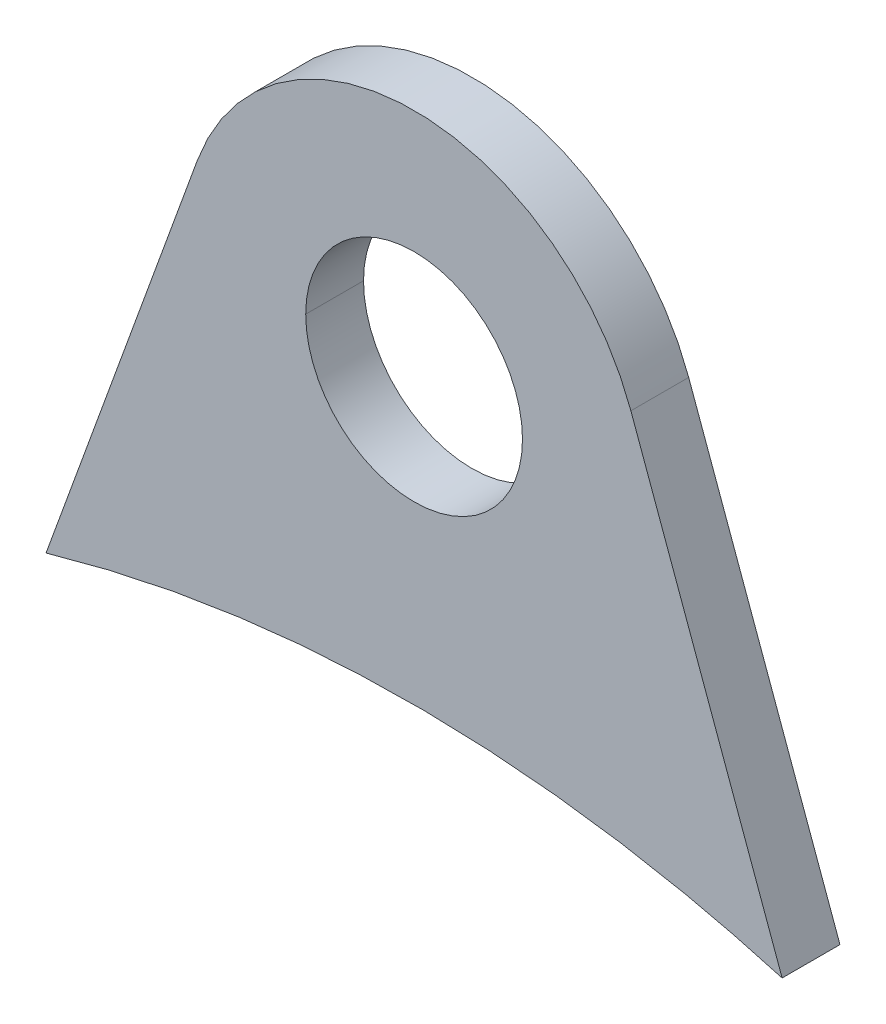
ISO-10303-21;
HEADER;
FILE_DESCRIPTION(('STEP AP214'),'2;1');
FILE_NAME('part.step','',(''),(''),'','','');
FILE_SCHEMA(('AUTOMOTIVE_DESIGN { 1 0 10303 214 1 1 1 1 }'));
ENDSEC;
DATA;
#1=APPLICATION_CONTEXT('core data for automotive mechanical design processes');
#2=APPLICATION_PROTOCOL_DEFINITION('international standard','automotive_design',2000,#1);
#3=PRODUCT_CONTEXT('',#1,'mechanical');
#4=PRODUCT('Part','Part','',(#3));
#5=PRODUCT_RELATED_PRODUCT_CATEGORY('part','',(#4));
#6=PRODUCT_DEFINITION_FORMATION('','',#4);
#7=PRODUCT_DEFINITION_CONTEXT('part definition',#1,'design');
#8=PRODUCT_DEFINITION('design','',#6,#7);
#9=PRODUCT_DEFINITION_SHAPE('','',#8);
#10=(LENGTH_UNIT() NAMED_UNIT(*) SI_UNIT(.MILLI.,.METRE.));
#11=(NAMED_UNIT(*) PLANE_ANGLE_UNIT() SI_UNIT($,.RADIAN.));
#12=(NAMED_UNIT(*) SI_UNIT($,.STERADIAN.) SOLID_ANGLE_UNIT());
#13=UNCERTAINTY_MEASURE_WITH_UNIT(LENGTH_MEASURE(1.E-05),#10,'distance_accuracy_value','');
#14=(GEOMETRIC_REPRESENTATION_CONTEXT(3) GLOBAL_UNCERTAINTY_ASSIGNED_CONTEXT((#13)) GLOBAL_UNIT_ASSIGNED_CONTEXT((#10,
#11,#12)) REPRESENTATION_CONTEXT('',''));
#15=CARTESIAN_POINT('',(0.,0.,0.));
#16=DIRECTION('',(0.,0.,1.));
#17=DIRECTION('',(1.,0.,0.));
#18=AXIS2_PLACEMENT_3D('',#15,#16,#17);
#19=CARTESIAN_POINT('',(237.511961473644,-296.982955426363,6.80414238108646E-12));
#20=DIRECTION('',(0.689605532614527,0.724185203789359,0.));
#21=DIRECTION('',(0.512076268434418,-0.487624748455492,0.707106781186548));
#22=AXIS2_PLACEMENT_3D('',#19,#20,#21);
#23=TOROIDAL_SURFACE('',#22,328.,181.5);
#24=CARTESIAN_POINT('',(50.7061588567263,103.465463207252,4.00000000000006));
#25=CARTESIAN_POINT('',(50.8043560138696,103.439726310511,3.3898563822652));
#26=CARTESIAN_POINT('',(50.8800297766086,103.419816936713,2.77674567944246));
#27=CARTESIAN_POINT('',(50.9331187111287,103.405836050409,2.16065704181465));
#28=(BOUNDED_CURVE() B_SPLINE_CURVE(3,(#24,#25,#26,#27),.UNSPECIFIED.,.F.,
.F.) B_SPLINE_CURVE_WITH_KNOTS((4,4),(2.0260284622211E-07,0.0018544541188316),
.UNSPECIFIED.) CURVE() GEOMETRIC_REPRESENTATION_ITEM() RATIONAL_B_SPLINE_CURVE((1.,1.,1.,1.)) REPRESENTATION_ITEM(''));
#29=CARTESIAN_POINT('',(50.7061588567263,103.465463207252,3.99999999999985));
#30=VERTEX_POINT('',#29);
#31=CARTESIAN_POINT('',(50.9331187111287,103.405836050409,2.16065704181465));
#32=VERTEX_POINT('',#31);
#33=EDGE_CURVE('E116',#30,#32,#28,.T.);
#34=ORIENTED_EDGE('',*,*,#33,.F.);
#35=CARTESIAN_POINT('',(-50.9331187111209,103.405836050411,3.99999999999963));
#36=CARTESIAN_POINT('',(-48.4554874316032,104.130085725673,3.99999999999963));
#37=CARTESIAN_POINT('',(-45.9623884437121,104.801410169951,3.99999999999963));
#38=CARTESIAN_POINT('',(-40.9498127506431,106.03714510248,3.99999999999963));
#39=CARTESIAN_POINT('',(-38.4303358460173,106.601554781712,3.99999999999963));
#40=CARTESIAN_POINT('',(-33.3691560762568,107.622475173787,3.99999999999963));
#41=CARTESIAN_POINT('',(-30.8274493923148,108.078966954495,3.99999999999963));
#42=CARTESIAN_POINT('',(-25.72690150179,108.883100152258,3.99999999999963));
#43=CARTESIAN_POINT('',(-23.1680604929796,109.230742823495,3.99999999999963));
#44=CARTESIAN_POINT('',(-18.0976552647956,109.809723605771,3.99999999999963));
#45=CARTESIAN_POINT('',(-15.5863785846811,110.043582769014,3.99999999999963));
#46=CARTESIAN_POINT('',(-10.5562643496409,110.406461640257,3.99999999999963));
#47=CARTESIAN_POINT('',(-8.03742680006194,110.535481422379,3.99999999999963));
#48=CARTESIAN_POINT('',(-2.99721715390254,110.688434022884,3.99999999999963));
#49=CARTESIAN_POINT('',(-0.475845909114352,110.71239476846,3.99999999999963));
#50=CARTESIAN_POINT('',(4.56549841829255,110.655276623093,3.99999999999963));
#51=CARTESIAN_POINT('',(7.08547157214704,110.574203694047,3.99999999999963));
#52=CARTESIAN_POINT('',(13.0518071298569,110.257706439247,3.99999999999963));
#53=CARTESIAN_POINT('',(16.4958354524429,109.976259544864,3.99999999999963));
#54=CARTESIAN_POINT('',(23.3614712063294,109.217399483766,3.99999999999963));
#55=CARTESIAN_POINT('',(26.783082269806,108.740018903234,3.99999999999963));
#56=CARTESIAN_POINT('',(33.649371278072,107.581388912212,3.99999999999963));
#57=CARTESIAN_POINT('',(37.0935134325157,106.896937551427,3.99999999999963));
#58=CARTESIAN_POINT('',(42.2255157604827,105.721407591177,3.99999999999963));
#59=CARTESIAN_POINT('',(43.9307273137237,105.304683892417,3.99999999999963));
#60=CARTESIAN_POINT('',(47.328350710528,104.421953788333,3.99999999999963));
#61=CARTESIAN_POINT('',(49.0207625237442,103.955947266204,3.99999999999963));
#62=CARTESIAN_POINT('',(50.7061588567263,103.465463207252,3.99999999999963));
#63=B_SPLINE_CURVE_WITH_KNOTS('',3,(#35,#36,#37,#38,#39,#40,#41,#42,#43,#44,#45,#46,#47,#48,#49,
#50,#51,#52,#53,#54,#55,#56,#57,#58,#59,#60,#61,#62),.UNSPECIFIED.,.F.,.F.,(4,2,2,2,2,2,2,2,2,2,
2,2,2,4),(0.,7.74335816604235,15.486774923301,23.2315491087712,30.9762340539659,38.540476529541,
46.1047136572073,53.666939908559,61.2287369333531,71.5893154197181,81.9481715121857,
92.4761918430972,97.7417364388833,103.007293514901),.UNSPECIFIED.);
#64=CARTESIAN_POINT('',(-50.9331187111209,103.40583605041,3.99999999999979));
#65=VERTEX_POINT('',#64);
#66=EDGE_CURVE('E21',#65,#30,#63,.T.);
#67=ORIENTED_EDGE('',*,*,#66,.F.);
#68=CARTESIAN_POINT('',(-50.9331187111191,103.405836050409,-3.99999999999995));
#69=CARTESIAN_POINT('',(-50.9250450949992,103.428018128398,-1.33333333333332));
#70=CARTESIAN_POINT('',(-50.9250450949992,103.428018128398,1.33333333333331));
#71=CARTESIAN_POINT('',(-50.9331187111208,103.40583605041,3.99999999999995));
#72=(BOUNDED_CURVE() B_SPLINE_CURVE(3,(#68,#69,#70,#71),.UNSPECIFIED.,.F.,
.F.) B_SPLINE_CURVE_WITH_KNOTS((4,4),(2.00000000172285E-07,0.0080002),
.UNSPECIFIED.) CURVE() GEOMETRIC_REPRESENTATION_ITEM() RATIONAL_B_SPLINE_CURVE((1.,1.,1.,1.)) REPRESENTATION_ITEM(''));
#73=CARTESIAN_POINT('',(-50.9331187111191,103.405836050409,-3.99999999999995));
#74=VERTEX_POINT('',#73);
#75=EDGE_CURVE('E11',#74,#65,#72,.T.);
#76=ORIENTED_EDGE('',*,*,#75,.F.);
#77=CARTESIAN_POINT('',(-50.9331187111196,103.405836050411,-4.00000000000027));
#78=CARTESIAN_POINT('',(-48.4554874316019,104.130085725673,-4.00000000000027));
#79=CARTESIAN_POINT('',(-45.9623884437107,104.801410169951,-4.00000000000027));
#80=CARTESIAN_POINT('',(-40.9498127506418,106.03714510248,-4.00000000000027));
#81=CARTESIAN_POINT('',(-38.430335846016,106.601554781712,-4.00000000000027));
#82=CARTESIAN_POINT('',(-33.3691560762554,107.622475173787,-4.00000000000027));
#83=CARTESIAN_POINT('',(-30.8274493923135,108.078966954495,-4.00000000000027));
#84=CARTESIAN_POINT('',(-25.7269015017887,108.883100152258,-4.00000000000027));
#85=CARTESIAN_POINT('',(-23.1680604929782,109.230742823495,-4.00000000000027));
#86=CARTESIAN_POINT('',(-18.0976552647942,109.809723605771,-4.00000000000027));
#87=CARTESIAN_POINT('',(-15.5863785846797,110.043582769014,-4.00000000000027));
#88=CARTESIAN_POINT('',(-10.5562643496395,110.406461640257,-4.00000000000027));
#89=CARTESIAN_POINT('',(-8.03742680006056,110.535481422379,-4.00000000000027));
#90=CARTESIAN_POINT('',(-2.99721715390116,110.688434022884,-4.00000000000027));
#91=CARTESIAN_POINT('',(-0.475845909112968,110.71239476846,-4.00000000000027));
#92=CARTESIAN_POINT('',(4.56549841829393,110.655276623093,-4.00000000000027));
#93=CARTESIAN_POINT('',(7.08547157214842,110.574203694047,-4.00000000000027));
#94=CARTESIAN_POINT('',(13.051807129858,110.257706439247,-4.00000000000027));
#95=CARTESIAN_POINT('',(16.4958354524437,109.976259544863,-4.00000000000027));
#96=CARTESIAN_POINT('',(23.3614712063295,109.217399483765,-4.00000000000027));
#97=CARTESIAN_POINT('',(26.7830822698058,108.740018903234,-4.00000000000027));
#98=CARTESIAN_POINT('',(33.6493712780711,107.581388912212,-4.00000000000027));
#99=CARTESIAN_POINT('',(37.0935134325145,106.896937551427,-4.00000000000027));
#100=CARTESIAN_POINT('',(42.2255157604811,105.721407591177,-4.00000000000027));
#101=CARTESIAN_POINT('',(43.9307273137219,105.304683892418,-4.00000000000027));
#102=CARTESIAN_POINT('',(47.3283507105259,104.421953788334,-4.00000000000027));
#103=CARTESIAN_POINT('',(49.0207625237419,103.955947266204,-4.00000000000027));
#104=CARTESIAN_POINT('',(50.7061588567239,103.465463207252,-4.00000000000027));
#105=B_SPLINE_CURVE_WITH_KNOTS('',3,(#77,#78,#79,#80,#81,#82,#83,#84,#85,#86,#87,#88,#89,#90,
#91,#92,#93,#94,#95,#96,#97,#98,#99,#100,#101,#102,#103,#104),.UNSPECIFIED.,.F.,.F.,(4,2,2,2,2,
2,2,2,2,2,2,2,2,4),(0.,7.74335816604234,15.486774923301,23.2315491087712,30.9762340539659,
38.540476529541,46.1047136572073,53.666939908559,61.2287369333531,71.5893154197171,
81.9481715121838,92.4761918430943,97.7417364388798,103.007293514897),.UNSPECIFIED.);
#106=CARTESIAN_POINT('',(50.7061588567238,103.465463207252,-4.00000000000011));
#107=VERTEX_POINT('',#106);
#108=EDGE_CURVE('E153',#74,#107,#105,.T.);
#109=ORIENTED_EDGE('',*,*,#108,.T.);
#110=CARTESIAN_POINT('',(50.9331187111263,103.405836050411,-2.16065704181975));
#111=CARTESIAN_POINT('',(50.8800297766088,103.419816936713,-2.77674567941059));
#112=CARTESIAN_POINT('',(50.8043560138694,103.439726310511,-3.38985638224946));
#113=CARTESIAN_POINT('',(50.7061588567238,103.465463207252,-3.99999999999995));
#114=(BOUNDED_CURVE() B_SPLINE_CURVE(3,(#110,#111,#112,#113),.UNSPECIFIED.,.F.,
.F.) B_SPLINE_CURVE_WITH_KNOTS((4,4),(2.32973146540902E-06,0.00185658124749898),
.UNSPECIFIED.) CURVE() GEOMETRIC_REPRESENTATION_ITEM() RATIONAL_B_SPLINE_CURVE((1.,1.,1.,1.)) REPRESENTATION_ITEM(''));
#115=CARTESIAN_POINT('',(50.9331187111263,103.405836050411,-2.16065704181975));
#116=VERTEX_POINT('',#115);
#117=EDGE_CURVE('E119',#116,#107,#114,.T.);
#118=ORIENTED_EDGE('',*,*,#117,.F.);
#119=CARTESIAN_POINT('',(50.9331187111287,103.405836050409,2.16065704181465));
#120=CARTESIAN_POINT('',(50.9316457595445,103.409882951618,0.720219013959351));
#121=CARTESIAN_POINT('',(50.9316457595445,103.409882951618,-0.720219013915347));
#122=CARTESIAN_POINT('',(50.9331187111263,103.405836050411,-2.16065704181975));
#123=B_SPLINE_CURVE_WITH_KNOTS('',3,(#119,#120,#121,#122),.UNSPECIFIED.,.F.,.F.,(4,4),(0.,1.),.UNSPECIFIED.);
#124=EDGE_CURVE('E49',#32,#116,#123,.T.);
#125=ORIENTED_EDGE('',*,*,#124,.F.);
#126=EDGE_LOOP('',(#34,#67,#76,#109,#118,#125));
#127=FACE_BOUND('',#126,.T.);
#128=ADVANCED_FACE('F17',(#127),#23,.F.);
#129=CARTESIAN_POINT('',(2.77555756156289E-12,149.999999999998,3.99999999999992));
#130=DIRECTION('',(0.,0.,-1.));
#131=DIRECTION('',(-1.,0.,0.));
#132=AXIS2_PLACEMENT_3D('',#129,#130,#131);
#133=CYLINDRICAL_SURFACE('',#132,15.);
#134=DIRECTION('',(0.,0.,-1.));
#135=VECTOR('',#134,1.);
#136=CARTESIAN_POINT('',(15.0000000000028,149.999999999998,3.99999999999992));
#137=LINE('',#136,#135);
#138=CARTESIAN_POINT('',(15.0000000000028,149.999999999998,3.99999999999992));
#139=VERTEX_POINT('',#138);
#140=CARTESIAN_POINT('',(15.0000000000031,149.999999999998,-3.99999999999995));
#141=VERTEX_POINT('',#140);
#142=EDGE_CURVE('E196',#139,#141,#137,.T.);
#143=ORIENTED_EDGE('',*,*,#142,.F.);
#144=CARTESIAN_POINT('',(2.77555756156289E-12,149.999999999998,3.99999999999992));
#145=DIRECTION('',(0.,0.,1.));
#146=DIRECTION('',(1.,0.,0.));
#147=AXIS2_PLACEMENT_3D('',#144,#145,#146);
#148=CIRCLE('',#147,15.);
#149=CARTESIAN_POINT('',(-14.9999999999972,149.999999999998,3.99999999999992));
#150=VERTEX_POINT('',#149);
#151=EDGE_CURVE('E164',#139,#150,#148,.T.);
#152=ORIENTED_EDGE('',*,*,#151,.T.);
#153=DIRECTION('',(0.,0.,-1.));
#154=VECTOR('',#153,1.);
#155=CARTESIAN_POINT('',(-14.9999999999972,149.999999999998,3.99999999999992));
#156=LINE('',#155,#154);
#157=CARTESIAN_POINT('',(-14.9999999999969,149.999999999998,-3.99999999999995));
#158=VERTEX_POINT('',#157);
#159=EDGE_CURVE('E142',#150,#158,#156,.T.);
#160=ORIENTED_EDGE('',*,*,#159,.T.);
#161=CARTESIAN_POINT('',(3.10862446895044E-12,149.999999999998,-3.99999999999995));
#162=DIRECTION('',(0.,0.,1.));
#163=DIRECTION('',(1.,0.,0.));
#164=AXIS2_PLACEMENT_3D('',#161,#162,#163);
#165=CIRCLE('',#164,15.);
#166=EDGE_CURVE('E200',#141,#158,#165,.T.);
#167=ORIENTED_EDGE('',*,*,#166,.F.);
#168=EDGE_LOOP('',(#143,#152,#160,#167));
#169=FACE_BOUND('',#168,.T.);
#170=ADVANCED_FACE('F172',(#169),#133,.F.);
#171=CARTESIAN_POINT('',(-50.9331187111208,103.40583605041,3.99999999999995));
#172=DIRECTION('',(0.93969262078591,-0.342020143325663,0.));
#173=DIRECTION('',(0.,0.,-1.));
#174=AXIS2_PLACEMENT_3D('',#171,#172,#173);
#175=PLANE('',#174);
#176=DIRECTION('',(-0.342020143325663,-0.93969262078591,0.));
#177=VECTOR('',#176,1.);
#178=CARTESIAN_POINT('',(-50.9331187111191,103.405836050409,-3.99999999999995));
#179=LINE('',#178,#177);
#180=CARTESIAN_POINT('',(-29.9999999999967,160.919107027985,-4.00000000000064));
#181=VERTEX_POINT('',#180);
#182=EDGE_CURVE('E163',#181,#74,#179,.T.);
#183=ORIENTED_EDGE('',*,*,#182,.T.);
#184=ORIENTED_EDGE('',*,*,#75,.T.);
#185=DIRECTION('',(-0.342020143325663,-0.93969262078591,0.));
#186=VECTOR('',#185,1.);
#187=CARTESIAN_POINT('',(-50.9331187111208,103.40583605041,3.99999999999995));
#188=LINE('',#187,#186);
#189=CARTESIAN_POINT('',(-29.9999999999971,160.919107027986,3.99999999999953));
#190=VERTEX_POINT('',#189);
#191=EDGE_CURVE('E131',#190,#65,#188,.T.);
#192=ORIENTED_EDGE('',*,*,#191,.F.);
#193=DIRECTION('',(0.,0.,-1.));
#194=VECTOR('',#193,1.);
#195=CARTESIAN_POINT('',(-29.9999999999971,160.919107027986,3.99999999999953));
#196=LINE('',#195,#194);
#197=EDGE_CURVE('E34',#190,#181,#196,.T.);
#198=ORIENTED_EDGE('',*,*,#197,.T.);
#199=EDGE_LOOP('',(#183,#184,#192,#198));
#200=FACE_BOUND('',#199,.T.);
#201=ADVANCED_FACE('F19',(#200),#175,.F.);
#202=CARTESIAN_POINT('',(2.77555756156289E-12,149.999999999998,3.99999999999992));
#203=DIRECTION('',(0.,0.,-1.));
#204=DIRECTION('',(-1.,0.,0.));
#205=AXIS2_PLACEMENT_3D('',#202,#203,#204);
#206=CYLINDRICAL_SURFACE('',#205,31.9253331742773);
#207=CARTESIAN_POINT('',(3.10862446895044E-12,149.999999999998,-3.99999999999995));
#208=DIRECTION('',(0.,0.,1.));
#209=DIRECTION('',(1.,0.,0.));
#210=AXIS2_PLACEMENT_3D('',#207,#208,#209);
#211=CIRCLE('',#210,31.9253331742773);
#212=CARTESIAN_POINT('',(30.0000000000022,160.919107027985,-4.));
#213=VERTEX_POINT('',#212);
#214=EDGE_CURVE('E222',#213,#181,#211,.T.);
#215=ORIENTED_EDGE('',*,*,#214,.T.);
#216=ORIENTED_EDGE('',*,*,#197,.F.);
#217=CARTESIAN_POINT('',(2.77555756156289E-12,149.999999999998,3.99999999999992));
#218=DIRECTION('',(0.,0.,1.));
#219=DIRECTION('',(1.,0.,0.));
#220=AXIS2_PLACEMENT_3D('',#217,#218,#219);
#221=CIRCLE('',#220,31.9253331742773);
#222=CARTESIAN_POINT('',(30.0000000000036,160.919107027984,4.));
#223=VERTEX_POINT('',#222);
#224=EDGE_CURVE('E216',#223,#190,#221,.T.);
#225=ORIENTED_EDGE('',*,*,#224,.F.);
#226=DIRECTION('',(0.,0.,-1.));
#227=VECTOR('',#226,1.);
#228=CARTESIAN_POINT('',(30.0000000000036,160.919107027984,4.));
#229=LINE('',#228,#227);
#230=EDGE_CURVE('E97',#223,#213,#229,.T.);
#231=ORIENTED_EDGE('',*,*,#230,.T.);
#232=EDGE_LOOP('',(#215,#216,#225,#231));
#233=FACE_BOUND('',#232,.T.);
#234=ADVANCED_FACE('F184',(#233),#206,.T.);
#235=CARTESIAN_POINT('',(50.9331187111253,103.40583605041,3.99999999999992));
#236=DIRECTION('',(-0.93969262078591,-0.342020143325663,0.));
#237=DIRECTION('',(-0.342020143325663,0.93969262078591,0.));
#238=AXIS2_PLACEMENT_3D('',#235,#236,#237);
#239=PLANE('',#238);
#240=DIRECTION('',(0.,0.,-1.));
#241=VECTOR('',#240,1.);
#242=CARTESIAN_POINT('',(50.9331187111253,103.40583605041,3.99999999999992));
#243=LINE('',#242,#241);
#244=CARTESIAN_POINT('',(50.9331187111253,103.40583605041,3.99999999999992));
#245=VERTEX_POINT('',#244);
#246=EDGE_CURVE('E124',#245,#32,#243,.T.);
#247=ORIENTED_EDGE('',*,*,#246,.T.);
#248=ORIENTED_EDGE('',*,*,#124,.T.);
#249=DIRECTION('',(0.,0.,-1.));
#250=VECTOR('',#249,1.);
#251=CARTESIAN_POINT('',(50.9331187111253,103.40583605041,3.99999999999992));
#252=LINE('',#251,#250);
#253=CARTESIAN_POINT('',(50.9331187111249,103.40583605041,-3.99999999999984));
#254=VERTEX_POINT('',#253);
#255=EDGE_CURVE('E223',#116,#254,#252,.T.);
#256=ORIENTED_EDGE('',*,*,#255,.T.);
#257=DIRECTION('',(-0.342020143325663,0.93969262078591,0.));
#258=VECTOR('',#257,1.);
#259=CARTESIAN_POINT('',(50.9331187111249,103.40583605041,-3.99999999999984));
#260=LINE('',#259,#258);
#261=EDGE_CURVE('E218',#254,#213,#260,.T.);
#262=ORIENTED_EDGE('',*,*,#261,.T.);
#263=ORIENTED_EDGE('',*,*,#230,.F.);
#264=DIRECTION('',(-0.342020143325663,0.93969262078591,0.));
#265=VECTOR('',#264,1.);
#266=CARTESIAN_POINT('',(50.9331187111253,103.40583605041,3.99999999999992));
#267=LINE('',#266,#265);
#268=EDGE_CURVE('E127',#245,#223,#267,.T.);
#269=ORIENTED_EDGE('',*,*,#268,.F.);
#270=EDGE_LOOP('',(#247,#248,#256,#262,#263,#269));
#271=FACE_BOUND('',#270,.T.);
#272=ADVANCED_FACE('F125',(#271),#239,.F.);
#273=CARTESIAN_POINT('',(3.77475828372554E-12,-90.0000000000014,3.99999999999965));
#274=DIRECTION('',(0.,0.,-1.));
#275=DIRECTION('',(-1.,0.,0.));
#276=AXIS2_PLACEMENT_3D('',#273,#274,#275);
#277=CYLINDRICAL_SURFACE('',#276,200.);
#278=ORIENTED_EDGE('',*,*,#255,.F.);
#279=ORIENTED_EDGE('',*,*,#117,.T.);
#280=CARTESIAN_POINT('',(3.44169137633799E-12,-90.000000000001,-4.00000000000025));
#281=DIRECTION('',(0.,0.,-1.));
#282=DIRECTION('',(-1.,0.,0.));
#283=AXIS2_PLACEMENT_3D('',#280,#281,#282);
#284=CIRCLE('',#283,200.);
#285=EDGE_CURVE('E221',#107,#254,#284,.T.);
#286=ORIENTED_EDGE('',*,*,#285,.T.);
#287=EDGE_LOOP('',(#278,#279,#286));
#288=FACE_BOUND('',#287,.T.);
#289=ADVANCED_FACE('F403',(#288),#277,.F.);
#290=CARTESIAN_POINT('',(3.44169137633799E-12,-90.000000000001,-4.00000000000025));
#291=DIRECTION('',(0.,0.,-1.));
#292=DIRECTION('',(0.,-1.,0.));
#293=AXIS2_PLACEMENT_3D('',#290,#291,#292);
#294=PLANE('',#293);
#295=CARTESIAN_POINT('',(3.10862446895044E-12,149.999999999998,-3.99999999999995));
#296=DIRECTION('',(0.,0.,1.));
#297=DIRECTION('',(1.,0.,0.));
#298=AXIS2_PLACEMENT_3D('',#295,#296,#297);
#299=CIRCLE('',#298,15.);
#300=EDGE_CURVE('E204',#158,#141,#299,.T.);
#301=ORIENTED_EDGE('',*,*,#300,.T.);
#302=ORIENTED_EDGE('',*,*,#166,.T.);
#303=EDGE_LOOP('',(#301,#302));
#304=FACE_BOUND('',#303,.T.);
#305=ORIENTED_EDGE('',*,*,#108,.F.);
#306=ORIENTED_EDGE('',*,*,#182,.F.);
#307=ORIENTED_EDGE('',*,*,#214,.F.);
#308=ORIENTED_EDGE('',*,*,#261,.F.);
#309=ORIENTED_EDGE('',*,*,#285,.F.);
#310=EDGE_LOOP('',(#305,#306,#307,#308,#309));
#311=FACE_BOUND('',#310,.T.);
#312=ADVANCED_FACE('F165',(#304,#311),#294,.T.);
#313=CARTESIAN_POINT('',(3.77475828372554E-12,-90.0000000000014,3.99999999999965));
#314=DIRECTION('',(0.,0.,-1.));
#315=DIRECTION('',(0.,-1.,0.));
#316=AXIS2_PLACEMENT_3D('',#313,#314,#315);
#317=PLANE('',#316);
#318=CARTESIAN_POINT('',(2.77555756156289E-12,149.999999999998,3.99999999999992));
#319=DIRECTION('',(0.,0.,1.));
#320=DIRECTION('',(1.,0.,0.));
#321=AXIS2_PLACEMENT_3D('',#318,#319,#320);
#322=CIRCLE('',#321,15.);
#323=EDGE_CURVE('E205',#150,#139,#322,.T.);
#324=ORIENTED_EDGE('',*,*,#323,.F.);
#325=ORIENTED_EDGE('',*,*,#151,.F.);
#326=EDGE_LOOP('',(#324,#325));
#327=FACE_BOUND('',#326,.T.);
#328=ORIENTED_EDGE('',*,*,#191,.T.);
#329=ORIENTED_EDGE('',*,*,#66,.T.);
#330=CARTESIAN_POINT('',(3.77475828372554E-12,-90.0000000000014,3.99999999999965));
#331=DIRECTION('',(0.,0.,-1.));
#332=DIRECTION('',(-1.,0.,0.));
#333=AXIS2_PLACEMENT_3D('',#330,#331,#332);
#334=CIRCLE('',#333,200.);
#335=EDGE_CURVE('E134',#30,#245,#334,.T.);
#336=ORIENTED_EDGE('',*,*,#335,.T.);
#337=ORIENTED_EDGE('',*,*,#268,.T.);
#338=ORIENTED_EDGE('',*,*,#224,.T.);
#339=EDGE_LOOP('',(#328,#329,#336,#337,#338));
#340=FACE_BOUND('',#339,.T.);
#341=ADVANCED_FACE('F176',(#327,#340),#317,.F.);
#342=CARTESIAN_POINT('',(3.77475828372554E-12,-90.0000000000014,3.99999999999965));
#343=DIRECTION('',(0.,0.,-1.));
#344=DIRECTION('',(-1.,0.,0.));
#345=AXIS2_PLACEMENT_3D('',#342,#343,#344);
#346=CYLINDRICAL_SURFACE('',#345,200.);
#347=ORIENTED_EDGE('',*,*,#335,.F.);
#348=ORIENTED_EDGE('',*,*,#33,.T.);
#349=ORIENTED_EDGE('',*,*,#246,.F.);
#350=EDGE_LOOP('',(#347,#348,#349));
#351=FACE_BOUND('',#350,.T.);
#352=ADVANCED_FACE('F133',(#351),#346,.F.);
#353=CARTESIAN_POINT('',(2.77555756156289E-12,149.999999999998,3.99999999999992));
#354=DIRECTION('',(0.,0.,-1.));
#355=DIRECTION('',(-1.,0.,0.));
#356=AXIS2_PLACEMENT_3D('',#353,#354,#355);
#357=CYLINDRICAL_SURFACE('',#356,15.);
#358=ORIENTED_EDGE('',*,*,#323,.T.);
#359=ORIENTED_EDGE('',*,*,#142,.T.);
#360=ORIENTED_EDGE('',*,*,#300,.F.);
#361=ORIENTED_EDGE('',*,*,#159,.F.);
#362=EDGE_LOOP('',(#358,#359,#360,#361));
#363=FACE_BOUND('',#362,.T.);
#364=ADVANCED_FACE('F175',(#363),#357,.F.);
#365=CLOSED_SHELL('',(#128,#170,#201,#234,#272,#289,#312,#341,#352,#364));
#366=MANIFOLD_SOLID_BREP('B1',#365);
#367=ADVANCED_BREP_SHAPE_REPRESENTATION('',(#18,#366),#14);
#368=SHAPE_DEFINITION_REPRESENTATION(#9,#367);
ENDSEC;
END-ISO-10303-21;
